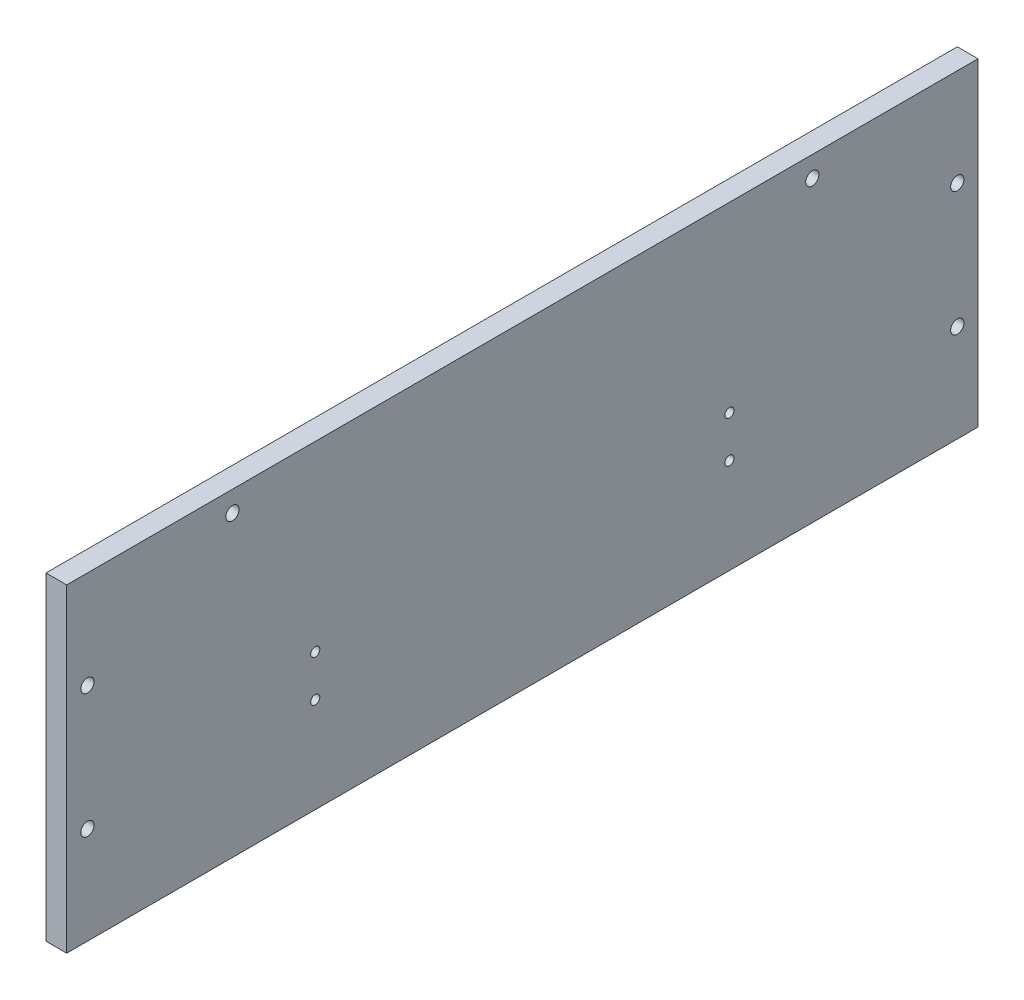
ISO-10303-21;
HEADER;
FILE_DESCRIPTION(('STEP AP214'),'2;1');
FILE_NAME('part.step','',(''),(''),'','','');
FILE_SCHEMA(('AUTOMOTIVE_DESIGN { 1 0 10303 214 1 1 1 1 }'));
ENDSEC;
DATA;
#1=APPLICATION_CONTEXT('core data for automotive mechanical design processes');
#2=APPLICATION_PROTOCOL_DEFINITION('international standard','automotive_design',2000,#1);
#3=PRODUCT_CONTEXT('',#1,'mechanical');
#4=PRODUCT('Part','Part','',(#3));
#5=PRODUCT_RELATED_PRODUCT_CATEGORY('part','',(#4));
#6=PRODUCT_DEFINITION_FORMATION('','',#4);
#7=PRODUCT_DEFINITION_CONTEXT('part definition',#1,'design');
#8=PRODUCT_DEFINITION('design','',#6,#7);
#9=PRODUCT_DEFINITION_SHAPE('','',#8);
#10=(LENGTH_UNIT() NAMED_UNIT(*) SI_UNIT(.MILLI.,.METRE.));
#11=(NAMED_UNIT(*) PLANE_ANGLE_UNIT() SI_UNIT($,.RADIAN.));
#12=(NAMED_UNIT(*) SI_UNIT($,.STERADIAN.) SOLID_ANGLE_UNIT());
#13=UNCERTAINTY_MEASURE_WITH_UNIT(LENGTH_MEASURE(1.E-05),#10,'distance_accuracy_value','');
#14=(GEOMETRIC_REPRESENTATION_CONTEXT(3) GLOBAL_UNCERTAINTY_ASSIGNED_CONTEXT((#13)) GLOBAL_UNIT_ASSIGNED_CONTEXT((#10,
#11,#12)) REPRESENTATION_CONTEXT('',''));
#15=CARTESIAN_POINT('',(0.,0.,0.));
#16=DIRECTION('',(0.,0.,1.));
#17=DIRECTION('',(1.,0.,0.));
#18=AXIS2_PLACEMENT_3D('',#15,#16,#17);
#19=CARTESIAN_POINT('',(-110.,110.,110.));
#20=DIRECTION('',(0.,1.,0.));
#21=DIRECTION('',(0.,0.,1.));
#22=AXIS2_PLACEMENT_3D('',#19,#20,#21);
#23=PLANE('',#22);
#24=DIRECTION('',(-1.,0.,0.));
#25=VECTOR('',#24,1.);
#26=CARTESIAN_POINT('',(-110.,110.,-110.));
#27=LINE('',#26,#25);
#28=CARTESIAN_POINT('',(-110.,110.,-110.));
#29=VERTEX_POINT('',#28);
#30=CARTESIAN_POINT('',(-115.,110.,-110.));
#31=VERTEX_POINT('',#30);
#32=EDGE_CURVE('E58',#29,#31,#27,.T.);
#33=ORIENTED_EDGE('',*,*,#32,.T.);
#34=DIRECTION('',(0.,0.,-1.));
#35=VECTOR('',#34,1.);
#36=CARTESIAN_POINT('',(-115.,110.,-115.));
#37=LINE('',#36,#35);
#38=CARTESIAN_POINT('',(-115.,110.,110.));
#39=VERTEX_POINT('',#38);
#40=EDGE_CURVE('E12',#39,#31,#37,.T.);
#41=ORIENTED_EDGE('',*,*,#40,.F.);
#42=DIRECTION('',(-1.,0.,0.));
#43=VECTOR('',#42,1.);
#44=CARTESIAN_POINT('',(-110.,110.,110.));
#45=LINE('',#44,#43);
#46=CARTESIAN_POINT('',(-110.,110.,110.));
#47=VERTEX_POINT('',#46);
#48=EDGE_CURVE('E49',#47,#39,#45,.T.);
#49=ORIENTED_EDGE('',*,*,#48,.F.);
#50=DIRECTION('',(0.,0.,-1.));
#51=VECTOR('',#50,1.);
#52=CARTESIAN_POINT('',(-110.,110.,-115.));
#53=LINE('',#52,#51);
#54=EDGE_CURVE('E38',#47,#29,#53,.T.);
#55=ORIENTED_EDGE('',*,*,#54,.T.);
#56=EDGE_LOOP('',(#33,#41,#49,#55));
#57=FACE_BOUND('',#56,.T.);
#58=ADVANCED_FACE('F35',(#57),#23,.T.);
#59=CARTESIAN_POINT('',(-110.,0.,0.));
#60=DIRECTION('',(-1.,0.,0.));
#61=DIRECTION('',(0.,0.,1.));
#62=AXIS2_PLACEMENT_3D('',#59,#60,#61);
#63=PLANE('',#62);
#64=CARTESIAN_POINT('',(-110.,105.,70.));
#65=DIRECTION('',(-1.,0.,0.));
#66=DIRECTION('',(0.,0.,1.));
#67=AXIS2_PLACEMENT_3D('',#64,#65,#66);
#68=CIRCLE('',#67,1.60000000000001);
#69=CARTESIAN_POINT('',(-110.,105.,71.6));
#70=VERTEX_POINT('',#69);
#71=EDGE_CURVE('E193',#70,#70,#68,.T.);
#72=ORIENTED_EDGE('',*,*,#71,.T.);
#73=EDGE_LOOP('',(#72));
#74=FACE_BOUND('',#73,.T.);
#75=CARTESIAN_POINT('',(-110.,56.5,-105.));
#76=DIRECTION('',(-1.,0.,0.));
#77=DIRECTION('',(0.,0.,-1.));
#78=AXIS2_PLACEMENT_3D('',#75,#76,#77);
#79=CIRCLE('',#78,1.60000000000001);
#80=CARTESIAN_POINT('',(-110.,56.5,-106.6));
#81=VERTEX_POINT('',#80);
#82=EDGE_CURVE('E186',#81,#81,#79,.T.);
#83=ORIENTED_EDGE('',*,*,#82,.T.);
#84=EDGE_LOOP('',(#83));
#85=FACE_BOUND('',#84,.T.);
#86=CARTESIAN_POINT('',(-110.,86.5,-105.));
#87=DIRECTION('',(-1.,0.,0.));
#88=DIRECTION('',(0.,0.,1.));
#89=AXIS2_PLACEMENT_3D('',#86,#87,#88);
#90=CIRCLE('',#89,1.60000000000001);
#91=CARTESIAN_POINT('',(-110.,86.5,-103.4));
#92=VERTEX_POINT('',#91);
#93=EDGE_CURVE('E204',#92,#92,#90,.T.);
#94=ORIENTED_EDGE('',*,*,#93,.T.);
#95=EDGE_LOOP('',(#94));
#96=FACE_BOUND('',#95,.T.);
#97=CARTESIAN_POINT('',(-110.,86.5,105.));
#98=DIRECTION('',(-1.,0.,0.));
#99=DIRECTION('',(0.,0.,-1.));
#100=AXIS2_PLACEMENT_3D('',#97,#98,#99);
#101=CIRCLE('',#100,1.60000000000001);
#102=CARTESIAN_POINT('',(-110.,86.5,103.4));
#103=VERTEX_POINT('',#102);
#104=EDGE_CURVE('E197',#103,#103,#101,.T.);
#105=ORIENTED_EDGE('',*,*,#104,.T.);
#106=EDGE_LOOP('',(#105));
#107=FACE_BOUND('',#106,.T.);
#108=CARTESIAN_POINT('',(-110.,105.,-70.));
#109=DIRECTION('',(-1.,0.,0.));
#110=DIRECTION('',(0.,0.,-1.));
#111=AXIS2_PLACEMENT_3D('',#108,#109,#110);
#112=CIRCLE('',#111,1.60000000000001);
#113=CARTESIAN_POINT('',(-110.,105.,-71.6));
#114=VERTEX_POINT('',#113);
#115=EDGE_CURVE('E177',#114,#114,#112,.T.);
#116=ORIENTED_EDGE('',*,*,#115,.T.);
#117=EDGE_LOOP('',(#116));
#118=FACE_BOUND('',#117,.T.);
#119=CARTESIAN_POINT('',(-110.,56.5,105.));
#120=DIRECTION('',(-1.,0.,0.));
#121=DIRECTION('',(0.,0.,1.));
#122=AXIS2_PLACEMENT_3D('',#119,#120,#121);
#123=CIRCLE('',#122,1.60000000000001);
#124=CARTESIAN_POINT('',(-110.,56.5,106.6));
#125=VERTEX_POINT('',#124);
#126=EDGE_CURVE('E209',#125,#125,#123,.T.);
#127=ORIENTED_EDGE('',*,*,#126,.T.);
#128=EDGE_LOOP('',(#127));
#129=FACE_BOUND('',#128,.T.);
#130=CARTESIAN_POINT('',(-110.,66.,-50.));
#131=DIRECTION('',(-1.,0.,0.));
#132=DIRECTION('',(0.,0.,-1.));
#133=AXIS2_PLACEMENT_3D('',#130,#131,#132);
#134=CIRCLE('',#133,1.10000000000001);
#135=CARTESIAN_POINT('',(-110.,66.,-51.1));
#136=VERTEX_POINT('',#135);
#137=EDGE_CURVE('E227',#136,#136,#134,.T.);
#138=ORIENTED_EDGE('',*,*,#137,.T.);
#139=EDGE_LOOP('',(#138));
#140=FACE_BOUND('',#139,.T.);
#141=CARTESIAN_POINT('',(-110.,56.,-50.));
#142=DIRECTION('',(-1.,0.,0.));
#143=DIRECTION('',(0.,0.,1.));
#144=AXIS2_PLACEMENT_3D('',#141,#142,#143);
#145=CIRCLE('',#144,1.10000000000001);
#146=CARTESIAN_POINT('',(-110.,56.,-48.9));
#147=VERTEX_POINT('',#146);
#148=EDGE_CURVE('E221',#147,#147,#145,.T.);
#149=ORIENTED_EDGE('',*,*,#148,.T.);
#150=EDGE_LOOP('',(#149));
#151=FACE_BOUND('',#150,.T.);
#152=CARTESIAN_POINT('',(-110.,56.,50.));
#153=DIRECTION('',(-1.,0.,0.));
#154=DIRECTION('',(0.,0.,-1.));
#155=AXIS2_PLACEMENT_3D('',#152,#153,#154);
#156=CIRCLE('',#155,1.10000000000001);
#157=CARTESIAN_POINT('',(-110.,56.,48.9));
#158=VERTEX_POINT('',#157);
#159=EDGE_CURVE('E215',#158,#158,#156,.T.);
#160=ORIENTED_EDGE('',*,*,#159,.T.);
#161=EDGE_LOOP('',(#160));
#162=FACE_BOUND('',#161,.T.);
#163=CARTESIAN_POINT('',(-110.,66.,50.));
#164=DIRECTION('',(-1.,0.,0.));
#165=DIRECTION('',(0.,0.,1.));
#166=AXIS2_PLACEMENT_3D('',#163,#164,#165);
#167=CIRCLE('',#166,1.10000000000001);
#168=CARTESIAN_POINT('',(-110.,66.,51.1));
#169=VERTEX_POINT('',#168);
#170=EDGE_CURVE('E105',#169,#169,#167,.T.);
#171=ORIENTED_EDGE('',*,*,#170,.T.);
#172=EDGE_LOOP('',(#171));
#173=FACE_BOUND('',#172,.T.);
#174=DIRECTION('',(0.,0.,-1.));
#175=VECTOR('',#174,1.);
#176=CARTESIAN_POINT('',(-110.,33.,-110.));
#177=LINE('',#176,#175);
#178=CARTESIAN_POINT('',(-110.,33.,110.));
#179=VERTEX_POINT('',#178);
#180=CARTESIAN_POINT('',(-110.,33.,-110.));
#181=VERTEX_POINT('',#180);
#182=EDGE_CURVE('E88',#179,#181,#177,.T.);
#183=ORIENTED_EDGE('',*,*,#182,.T.);
#184=DIRECTION('',(0.,1.,0.));
#185=VECTOR('',#184,1.);
#186=CARTESIAN_POINT('',(-110.,33.,-110.));
#187=LINE('',#186,#185);
#188=EDGE_CURVE('E91',#181,#29,#187,.T.);
#189=ORIENTED_EDGE('',*,*,#188,.T.);
#190=ORIENTED_EDGE('',*,*,#54,.F.);
#191=DIRECTION('',(0.,-1.,0.));
#192=VECTOR('',#191,1.);
#193=CARTESIAN_POINT('',(-110.,110.,110.));
#194=LINE('',#193,#192);
#195=EDGE_CURVE('E77',#47,#179,#194,.T.);
#196=ORIENTED_EDGE('',*,*,#195,.T.);
#197=EDGE_LOOP('',(#183,#189,#190,#196));
#198=FACE_BOUND('',#197,.T.);
#199=ADVANCED_FACE('F94',(#74,#85,#96,#107,#118,#129,#140,#151,#162,#173,#198),#63,.F.);
#200=CARTESIAN_POINT('',(-115.,0.,0.));
#201=DIRECTION('',(-1.,0.,0.));
#202=DIRECTION('',(0.,0.,1.));
#203=AXIS2_PLACEMENT_3D('',#200,#201,#202);
#204=PLANE('',#203);
#205=CARTESIAN_POINT('',(-115.,105.,70.));
#206=DIRECTION('',(-1.,0.,0.));
#207=DIRECTION('',(0.,0.,1.));
#208=AXIS2_PLACEMENT_3D('',#205,#206,#207);
#209=CIRCLE('',#208,1.60000000000001);
#210=CARTESIAN_POINT('',(-115.,105.,71.6));
#211=VERTEX_POINT('',#210);
#212=EDGE_CURVE('E183',#211,#211,#209,.T.);
#213=ORIENTED_EDGE('',*,*,#212,.F.);
#214=EDGE_LOOP('',(#213));
#215=FACE_BOUND('',#214,.T.);
#216=CARTESIAN_POINT('',(-115.,56.5,-105.));
#217=DIRECTION('',(-1.,0.,0.));
#218=DIRECTION('',(0.,0.,-1.));
#219=AXIS2_PLACEMENT_3D('',#216,#217,#218);
#220=CIRCLE('',#219,1.60000000000001);
#221=CARTESIAN_POINT('',(-115.,56.5,-106.6));
#222=VERTEX_POINT('',#221);
#223=EDGE_CURVE('E190',#222,#222,#220,.T.);
#224=ORIENTED_EDGE('',*,*,#223,.F.);
#225=EDGE_LOOP('',(#224));
#226=FACE_BOUND('',#225,.T.);
#227=CARTESIAN_POINT('',(-115.,86.5,-105.));
#228=DIRECTION('',(-1.,0.,0.));
#229=DIRECTION('',(0.,0.,1.));
#230=AXIS2_PLACEMENT_3D('',#227,#228,#229);
#231=CIRCLE('',#230,1.60000000000001);
#232=CARTESIAN_POINT('',(-115.,86.5,-103.4));
#233=VERTEX_POINT('',#232);
#234=EDGE_CURVE('E189',#233,#233,#231,.T.);
#235=ORIENTED_EDGE('',*,*,#234,.F.);
#236=EDGE_LOOP('',(#235));
#237=FACE_BOUND('',#236,.T.);
#238=CARTESIAN_POINT('',(-115.,86.5,105.));
#239=DIRECTION('',(-1.,0.,0.));
#240=DIRECTION('',(0.,0.,-1.));
#241=AXIS2_PLACEMENT_3D('',#238,#239,#240);
#242=CIRCLE('',#241,1.60000000000001);
#243=CARTESIAN_POINT('',(-115.,86.5,103.4));
#244=VERTEX_POINT('',#243);
#245=EDGE_CURVE('E201',#244,#244,#242,.T.);
#246=ORIENTED_EDGE('',*,*,#245,.F.);
#247=EDGE_LOOP('',(#246));
#248=FACE_BOUND('',#247,.T.);
#249=CARTESIAN_POINT('',(-115.,105.,-70.));
#250=DIRECTION('',(-1.,0.,0.));
#251=DIRECTION('',(0.,0.,-1.));
#252=AXIS2_PLACEMENT_3D('',#249,#250,#251);
#253=CIRCLE('',#252,1.60000000000001);
#254=CARTESIAN_POINT('',(-115.,105.,-71.6));
#255=VERTEX_POINT('',#254);
#256=EDGE_CURVE('E180',#255,#255,#253,.T.);
#257=ORIENTED_EDGE('',*,*,#256,.F.);
#258=EDGE_LOOP('',(#257));
#259=FACE_BOUND('',#258,.T.);
#260=CARTESIAN_POINT('',(-115.,56.5,105.));
#261=DIRECTION('',(-1.,0.,0.));
#262=DIRECTION('',(0.,0.,1.));
#263=AXIS2_PLACEMENT_3D('',#260,#261,#262);
#264=CIRCLE('',#263,1.60000000000001);
#265=CARTESIAN_POINT('',(-115.,56.5,106.6));
#266=VERTEX_POINT('',#265);
#267=EDGE_CURVE('E200',#266,#266,#264,.T.);
#268=ORIENTED_EDGE('',*,*,#267,.F.);
#269=EDGE_LOOP('',(#268));
#270=FACE_BOUND('',#269,.T.);
#271=CARTESIAN_POINT('',(-115.,66.,-50.));
#272=DIRECTION('',(-1.,0.,0.));
#273=DIRECTION('',(0.,0.,-1.));
#274=AXIS2_PLACEMENT_3D('',#271,#272,#273);
#275=CIRCLE('',#274,1.10000000000001);
#276=CARTESIAN_POINT('',(-115.,66.,-51.1));
#277=VERTEX_POINT('',#276);
#278=EDGE_CURVE('E212',#277,#277,#275,.T.);
#279=ORIENTED_EDGE('',*,*,#278,.F.);
#280=EDGE_LOOP('',(#279));
#281=FACE_BOUND('',#280,.T.);
#282=CARTESIAN_POINT('',(-115.,56.,-50.));
#283=DIRECTION('',(-1.,0.,0.));
#284=DIRECTION('',(0.,0.,1.));
#285=AXIS2_PLACEMENT_3D('',#282,#283,#284);
#286=CIRCLE('',#285,1.10000000000001);
#287=CARTESIAN_POINT('',(-115.,56.,-48.9));
#288=VERTEX_POINT('',#287);
#289=EDGE_CURVE('E224',#288,#288,#286,.T.);
#290=ORIENTED_EDGE('',*,*,#289,.F.);
#291=EDGE_LOOP('',(#290));
#292=FACE_BOUND('',#291,.T.);
#293=CARTESIAN_POINT('',(-115.,56.,50.));
#294=DIRECTION('',(-1.,0.,0.));
#295=DIRECTION('',(0.,0.,-1.));
#296=AXIS2_PLACEMENT_3D('',#293,#294,#295);
#297=CIRCLE('',#296,1.10000000000001);
#298=CARTESIAN_POINT('',(-115.,56.,48.9));
#299=VERTEX_POINT('',#298);
#300=EDGE_CURVE('E218',#299,#299,#297,.T.);
#301=ORIENTED_EDGE('',*,*,#300,.F.);
#302=EDGE_LOOP('',(#301));
#303=FACE_BOUND('',#302,.T.);
#304=CARTESIAN_POINT('',(-115.,66.,50.));
#305=DIRECTION('',(-1.,0.,0.));
#306=DIRECTION('',(0.,0.,1.));
#307=AXIS2_PLACEMENT_3D('',#304,#305,#306);
#308=CIRCLE('',#307,1.10000000000001);
#309=CARTESIAN_POINT('',(-115.,66.,51.1));
#310=VERTEX_POINT('',#309);
#311=EDGE_CURVE('E100',#310,#310,#308,.T.);
#312=ORIENTED_EDGE('',*,*,#311,.F.);
#313=EDGE_LOOP('',(#312));
#314=FACE_BOUND('',#313,.T.);
#315=DIRECTION('',(0.,1.,0.));
#316=VECTOR('',#315,1.);
#317=CARTESIAN_POINT('',(-115.,33.,-110.));
#318=LINE('',#317,#316);
#319=CARTESIAN_POINT('',(-115.,33.,-110.));
#320=VERTEX_POINT('',#319);
#321=EDGE_CURVE('E73',#320,#31,#318,.T.);
#322=ORIENTED_EDGE('',*,*,#321,.F.);
#323=DIRECTION('',(0.,0.,-1.));
#324=VECTOR('',#323,1.);
#325=CARTESIAN_POINT('',(-115.,33.,-110.));
#326=LINE('',#325,#324);
#327=CARTESIAN_POINT('',(-115.,33.,110.));
#328=VERTEX_POINT('',#327);
#329=EDGE_CURVE('E97',#328,#320,#326,.T.);
#330=ORIENTED_EDGE('',*,*,#329,.F.);
#331=DIRECTION('',(0.,-1.,0.));
#332=VECTOR('',#331,1.);
#333=CARTESIAN_POINT('',(-115.,110.,110.));
#334=LINE('',#333,#332);
#335=EDGE_CURVE('E81',#39,#328,#334,.T.);
#336=ORIENTED_EDGE('',*,*,#335,.F.);
#337=ORIENTED_EDGE('',*,*,#40,.T.);
#338=EDGE_LOOP('',(#322,#330,#336,#337));
#339=FACE_BOUND('',#338,.T.);
#340=ADVANCED_FACE('F111',(#215,#226,#237,#248,#259,#270,#281,#292,#303,#314,#339),#204,.T.);
#341=CARTESIAN_POINT('',(-110.,33.,-110.));
#342=DIRECTION('',(0.,0.,1.));
#343=DIRECTION('',(1.,0.,0.));
#344=AXIS2_PLACEMENT_3D('',#341,#342,#343);
#345=PLANE('',#344);
#346=ORIENTED_EDGE('',*,*,#321,.T.);
#347=ORIENTED_EDGE('',*,*,#32,.F.);
#348=ORIENTED_EDGE('',*,*,#188,.F.);
#349=DIRECTION('',(-1.,0.,0.));
#350=VECTOR('',#349,1.);
#351=CARTESIAN_POINT('',(-110.,33.,-110.));
#352=LINE('',#351,#350);
#353=EDGE_CURVE('E85',#181,#320,#352,.T.);
#354=ORIENTED_EDGE('',*,*,#353,.T.);
#355=EDGE_LOOP('',(#346,#347,#348,#354));
#356=FACE_BOUND('',#355,.T.);
#357=ADVANCED_FACE('F109',(#356),#345,.F.);
#358=CARTESIAN_POINT('',(-110.,33.,-110.));
#359=DIRECTION('',(0.,1.,0.));
#360=DIRECTION('',(0.,0.,1.));
#361=AXIS2_PLACEMENT_3D('',#358,#359,#360);
#362=PLANE('',#361);
#363=ORIENTED_EDGE('',*,*,#329,.T.);
#364=ORIENTED_EDGE('',*,*,#353,.F.);
#365=ORIENTED_EDGE('',*,*,#182,.F.);
#366=DIRECTION('',(-1.,0.,0.));
#367=VECTOR('',#366,1.);
#368=CARTESIAN_POINT('',(-110.,33.,110.));
#369=LINE('',#368,#367);
#370=EDGE_CURVE('E78',#179,#328,#369,.T.);
#371=ORIENTED_EDGE('',*,*,#370,.T.);
#372=EDGE_LOOP('',(#363,#364,#365,#371));
#373=FACE_BOUND('',#372,.T.);
#374=ADVANCED_FACE('F89',(#373),#362,.F.);
#375=CARTESIAN_POINT('',(-110.,110.,110.));
#376=DIRECTION('',(0.,0.,-1.));
#377=DIRECTION('',(-1.,0.,0.));
#378=AXIS2_PLACEMENT_3D('',#375,#376,#377);
#379=PLANE('',#378);
#380=ORIENTED_EDGE('',*,*,#335,.T.);
#381=ORIENTED_EDGE('',*,*,#370,.F.);
#382=ORIENTED_EDGE('',*,*,#195,.F.);
#383=ORIENTED_EDGE('',*,*,#48,.T.);
#384=EDGE_LOOP('',(#380,#381,#382,#383));
#385=FACE_BOUND('',#384,.T.);
#386=ADVANCED_FACE('F80',(#385),#379,.F.);
#387=CARTESIAN_POINT('',(-110.,66.,50.));
#388=DIRECTION('',(-1.,0.,0.));
#389=DIRECTION('',(0.,0.,1.));
#390=AXIS2_PLACEMENT_3D('',#387,#388,#389);
#391=CYLINDRICAL_SURFACE('',#390,1.10000000000001);
#392=ORIENTED_EDGE('',*,*,#170,.F.);
#393=EDGE_LOOP('',(#392));
#394=FACE_BOUND('',#393,.T.);
#395=ORIENTED_EDGE('',*,*,#311,.T.);
#396=EDGE_LOOP('',(#395));
#397=FACE_BOUND('',#396,.T.);
#398=ADVANCED_FACE('F129',(#394,#397),#391,.F.);
#399=CARTESIAN_POINT('',(-110.,56.,50.));
#400=DIRECTION('',(-1.,0.,0.));
#401=DIRECTION('',(0.,0.,1.));
#402=AXIS2_PLACEMENT_3D('',#399,#400,#401);
#403=CYLINDRICAL_SURFACE('',#402,1.10000000000001);
#404=ORIENTED_EDGE('',*,*,#159,.F.);
#405=EDGE_LOOP('',(#404));
#406=FACE_BOUND('',#405,.T.);
#407=ORIENTED_EDGE('',*,*,#300,.T.);
#408=EDGE_LOOP('',(#407));
#409=FACE_BOUND('',#408,.T.);
#410=ADVANCED_FACE('F136',(#406,#409),#403,.F.);
#411=CARTESIAN_POINT('',(-110.,56.,-50.));
#412=DIRECTION('',(-1.,0.,0.));
#413=DIRECTION('',(0.,0.,1.));
#414=AXIS2_PLACEMENT_3D('',#411,#412,#413);
#415=CYLINDRICAL_SURFACE('',#414,1.10000000000001);
#416=ORIENTED_EDGE('',*,*,#148,.F.);
#417=EDGE_LOOP('',(#416));
#418=FACE_BOUND('',#417,.T.);
#419=ORIENTED_EDGE('',*,*,#289,.T.);
#420=EDGE_LOOP('',(#419));
#421=FACE_BOUND('',#420,.T.);
#422=ADVANCED_FACE('F142',(#418,#421),#415,.F.);
#423=CARTESIAN_POINT('',(-110.,66.,-50.));
#424=DIRECTION('',(-1.,0.,0.));
#425=DIRECTION('',(0.,0.,1.));
#426=AXIS2_PLACEMENT_3D('',#423,#424,#425);
#427=CYLINDRICAL_SURFACE('',#426,1.10000000000001);
#428=ORIENTED_EDGE('',*,*,#137,.F.);
#429=EDGE_LOOP('',(#428));
#430=FACE_BOUND('',#429,.T.);
#431=ORIENTED_EDGE('',*,*,#278,.T.);
#432=EDGE_LOOP('',(#431));
#433=FACE_BOUND('',#432,.T.);
#434=ADVANCED_FACE('F138',(#430,#433),#427,.F.);
#435=CARTESIAN_POINT('',(-110.,56.5,105.));
#436=DIRECTION('',(-1.,0.,0.));
#437=DIRECTION('',(0.,0.,1.));
#438=AXIS2_PLACEMENT_3D('',#435,#436,#437);
#439=CYLINDRICAL_SURFACE('',#438,1.60000000000001);
#440=ORIENTED_EDGE('',*,*,#126,.F.);
#441=EDGE_LOOP('',(#440));
#442=FACE_BOUND('',#441,.T.);
#443=ORIENTED_EDGE('',*,*,#267,.T.);
#444=EDGE_LOOP('',(#443));
#445=FACE_BOUND('',#444,.T.);
#446=ADVANCED_FACE('F141',(#442,#445),#439,.F.);
#447=CARTESIAN_POINT('',(-110.,105.,-70.));
#448=DIRECTION('',(-1.,0.,0.));
#449=DIRECTION('',(0.,0.,1.));
#450=AXIS2_PLACEMENT_3D('',#447,#448,#449);
#451=CYLINDRICAL_SURFACE('',#450,1.60000000000001);
#452=ORIENTED_EDGE('',*,*,#115,.F.);
#453=EDGE_LOOP('',(#452));
#454=FACE_BOUND('',#453,.T.);
#455=ORIENTED_EDGE('',*,*,#256,.T.);
#456=EDGE_LOOP('',(#455));
#457=FACE_BOUND('',#456,.T.);
#458=ADVANCED_FACE('F152',(#454,#457),#451,.F.);
#459=CARTESIAN_POINT('',(-110.,86.5,105.));
#460=DIRECTION('',(-1.,0.,0.));
#461=DIRECTION('',(0.,0.,1.));
#462=AXIS2_PLACEMENT_3D('',#459,#460,#461);
#463=CYLINDRICAL_SURFACE('',#462,1.60000000000001);
#464=ORIENTED_EDGE('',*,*,#104,.F.);
#465=EDGE_LOOP('',(#464));
#466=FACE_BOUND('',#465,.T.);
#467=ORIENTED_EDGE('',*,*,#245,.T.);
#468=EDGE_LOOP('',(#467));
#469=FACE_BOUND('',#468,.T.);
#470=ADVANCED_FACE('F158',(#466,#469),#463,.F.);
#471=CARTESIAN_POINT('',(-110.,86.5,-105.));
#472=DIRECTION('',(-1.,0.,0.));
#473=DIRECTION('',(0.,0.,1.));
#474=AXIS2_PLACEMENT_3D('',#471,#472,#473);
#475=CYLINDRICAL_SURFACE('',#474,1.60000000000001);
#476=ORIENTED_EDGE('',*,*,#93,.F.);
#477=EDGE_LOOP('',(#476));
#478=FACE_BOUND('',#477,.T.);
#479=ORIENTED_EDGE('',*,*,#234,.T.);
#480=EDGE_LOOP('',(#479));
#481=FACE_BOUND('',#480,.T.);
#482=ADVANCED_FACE('F154',(#478,#481),#475,.F.);
#483=CARTESIAN_POINT('',(-110.,56.5,-105.));
#484=DIRECTION('',(-1.,0.,0.));
#485=DIRECTION('',(0.,0.,1.));
#486=AXIS2_PLACEMENT_3D('',#483,#484,#485);
#487=CYLINDRICAL_SURFACE('',#486,1.60000000000001);
#488=ORIENTED_EDGE('',*,*,#82,.F.);
#489=EDGE_LOOP('',(#488));
#490=FACE_BOUND('',#489,.T.);
#491=ORIENTED_EDGE('',*,*,#223,.T.);
#492=EDGE_LOOP('',(#491));
#493=FACE_BOUND('',#492,.T.);
#494=ADVANCED_FACE('F157',(#490,#493),#487,.F.);
#495=CARTESIAN_POINT('',(-110.,105.,70.));
#496=DIRECTION('',(-1.,0.,0.));
#497=DIRECTION('',(0.,0.,1.));
#498=AXIS2_PLACEMENT_3D('',#495,#496,#497);
#499=CYLINDRICAL_SURFACE('',#498,1.60000000000001);
#500=ORIENTED_EDGE('',*,*,#71,.F.);
#501=EDGE_LOOP('',(#500));
#502=FACE_BOUND('',#501,.T.);
#503=ORIENTED_EDGE('',*,*,#212,.T.);
#504=EDGE_LOOP('',(#503));
#505=FACE_BOUND('',#504,.T.);
#506=ADVANCED_FACE('F163',(#502,#505),#499,.F.);
#507=CLOSED_SHELL('',(#58,#199,#340,#357,#374,#386,#398,#410,#422,#434,#446,#458,#470,#482,#494,#506));
#508=MANIFOLD_SOLID_BREP('B2',#507);
#509=ADVANCED_BREP_SHAPE_REPRESENTATION('',(#18,#508),#14);
#510=SHAPE_DEFINITION_REPRESENTATION(#9,#509);
ENDSEC;
END-ISO-10303-21;
